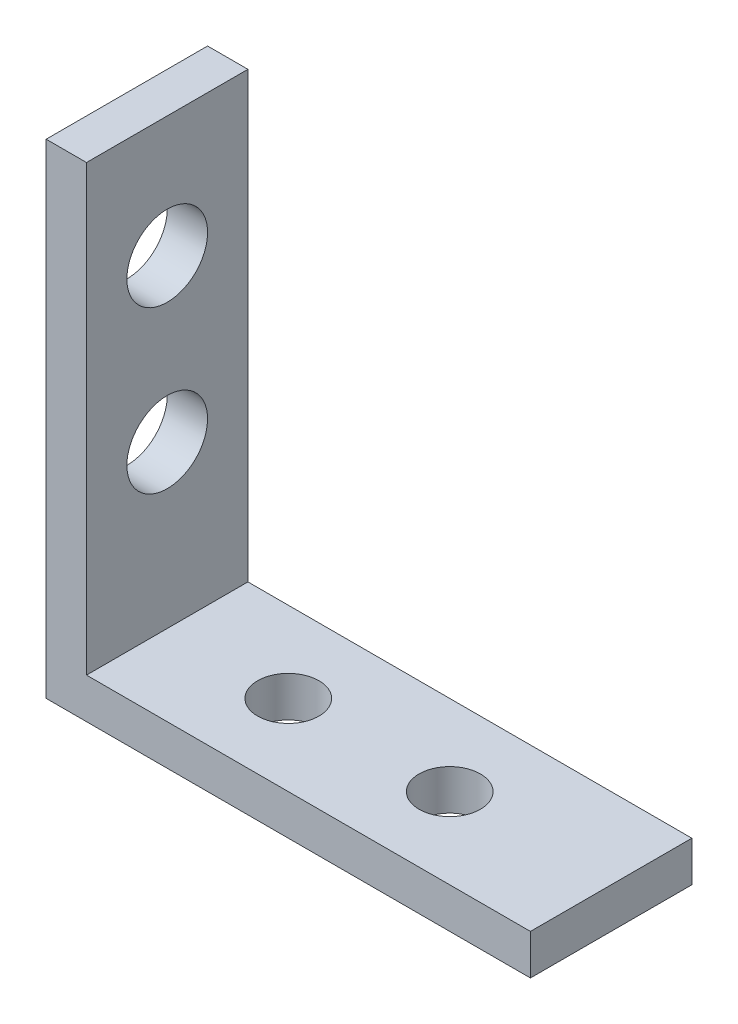
ISO-10303-21;
HEADER;
FILE_DESCRIPTION(('STEP AP214'),'2;1');
FILE_NAME('part.step','',(''),(''),'','','');
FILE_SCHEMA(('AUTOMOTIVE_DESIGN { 1 0 10303 214 1 1 1 1 }'));
ENDSEC;
DATA;
#1=APPLICATION_CONTEXT('core data for automotive mechanical design processes');
#2=APPLICATION_PROTOCOL_DEFINITION('international standard','automotive_design',2000,#1);
#3=PRODUCT_CONTEXT('',#1,'mechanical');
#4=PRODUCT('Part','Part','',(#3));
#5=PRODUCT_RELATED_PRODUCT_CATEGORY('part','',(#4));
#6=PRODUCT_DEFINITION_FORMATION('','',#4);
#7=PRODUCT_DEFINITION_CONTEXT('part definition',#1,'design');
#8=PRODUCT_DEFINITION('design','',#6,#7);
#9=PRODUCT_DEFINITION_SHAPE('','',#8);
#10=(LENGTH_UNIT() NAMED_UNIT(*) SI_UNIT(.MILLI.,.METRE.));
#11=(NAMED_UNIT(*) PLANE_ANGLE_UNIT() SI_UNIT($,.RADIAN.));
#12=(NAMED_UNIT(*) SI_UNIT($,.STERADIAN.) SOLID_ANGLE_UNIT());
#13=UNCERTAINTY_MEASURE_WITH_UNIT(LENGTH_MEASURE(1.E-05),#10,'distance_accuracy_value','');
#14=(GEOMETRIC_REPRESENTATION_CONTEXT(3) GLOBAL_UNCERTAINTY_ASSIGNED_CONTEXT((#13)) GLOBAL_UNIT_ASSIGNED_CONTEXT((#10,
#11,#12)) REPRESENTATION_CONTEXT('',''));
#15=CARTESIAN_POINT('',(0.,0.,0.));
#16=DIRECTION('',(0.,0.,1.));
#17=DIRECTION('',(1.,0.,0.));
#18=AXIS2_PLACEMENT_3D('',#15,#16,#17);
#19=CARTESIAN_POINT('',(38.1,0.,12.7));
#20=DIRECTION('',(0.,1.,0.));
#21=DIRECTION('',(-1.,0.,0.));
#22=AXIS2_PLACEMENT_3D('',#19,#20,#21);
#23=PLANE('',#22);
#24=CARTESIAN_POINT('',(25.4,0.,6.35));
#25=DIRECTION('',(0.,1.,0.));
#26=DIRECTION('',(-1.,0.,0.));
#27=AXIS2_PLACEMENT_3D('',#24,#25,#26);
#28=CIRCLE('',#27,2.413);
#29=CARTESIAN_POINT('',(22.987,0.,6.35));
#30=VERTEX_POINT('',#29);
#31=EDGE_CURVE('E162',#30,#30,#28,.T.);
#32=ORIENTED_EDGE('',*,*,#31,.T.);
#33=EDGE_LOOP('',(#32));
#34=FACE_BOUND('',#33,.T.);
#35=CARTESIAN_POINT('',(12.7,0.,6.35));
#36=DIRECTION('',(0.,1.,0.));
#37=DIRECTION('',(-1.,0.,0.));
#38=AXIS2_PLACEMENT_3D('',#35,#36,#37);
#39=CIRCLE('',#38,2.413);
#40=CARTESIAN_POINT('',(10.287,0.,6.35));
#41=VERTEX_POINT('',#40);
#42=EDGE_CURVE('E120',#41,#41,#39,.T.);
#43=ORIENTED_EDGE('',*,*,#42,.T.);
#44=EDGE_LOOP('',(#43));
#45=FACE_BOUND('',#44,.T.);
#46=DIRECTION('',(1.,0.,0.));
#47=VECTOR('',#46,1.);
#48=CARTESIAN_POINT('',(38.1,0.,0.));
#49=LINE('',#48,#47);
#50=CARTESIAN_POINT('',(0.,0.,0.));
#51=VERTEX_POINT('',#50);
#52=CARTESIAN_POINT('',(38.1,0.,0.));
#53=VERTEX_POINT('',#52);
#54=EDGE_CURVE('E116',#51,#53,#49,.T.);
#55=ORIENTED_EDGE('',*,*,#54,.T.);
#56=DIRECTION('',(0.,0.,-1.));
#57=VECTOR('',#56,1.);
#58=CARTESIAN_POINT('',(38.1,0.,12.7));
#59=LINE('',#58,#57);
#60=CARTESIAN_POINT('',(38.1,0.,12.7));
#61=VERTEX_POINT('',#60);
#62=EDGE_CURVE('E11',#61,#53,#59,.T.);
#63=ORIENTED_EDGE('',*,*,#62,.F.);
#64=DIRECTION('',(1.,0.,0.));
#65=VECTOR('',#64,1.);
#66=CARTESIAN_POINT('',(38.1,0.,12.7));
#67=LINE('',#66,#65);
#68=CARTESIAN_POINT('',(0.,0.,12.7));
#69=VERTEX_POINT('',#68);
#70=EDGE_CURVE('E127',#69,#61,#67,.T.);
#71=ORIENTED_EDGE('',*,*,#70,.F.);
#72=DIRECTION('',(0.,0.,-1.));
#73=VECTOR('',#72,1.);
#74=CARTESIAN_POINT('',(0.,0.,12.7));
#75=LINE('',#74,#73);
#76=EDGE_CURVE('E112',#69,#51,#75,.T.);
#77=ORIENTED_EDGE('',*,*,#76,.T.);
#78=EDGE_LOOP('',(#55,#63,#71,#77));
#79=FACE_BOUND('',#78,.T.);
#80=ADVANCED_FACE('F32',(#34,#45,#79),#23,.F.);
#81=CARTESIAN_POINT('',(38.1,3.175,12.7));
#82=DIRECTION('',(-1.,0.,0.));
#83=DIRECTION('',(0.,0.,1.));
#84=AXIS2_PLACEMENT_3D('',#81,#82,#83);
#85=PLANE('',#84);
#86=DIRECTION('',(0.,1.,0.));
#87=VECTOR('',#86,1.);
#88=CARTESIAN_POINT('',(38.1,3.175,0.));
#89=LINE('',#88,#87);
#90=CARTESIAN_POINT('',(38.1,3.175,0.));
#91=VERTEX_POINT('',#90);
#92=EDGE_CURVE('E119',#53,#91,#89,.T.);
#93=ORIENTED_EDGE('',*,*,#92,.T.);
#94=DIRECTION('',(0.,0.,-1.));
#95=VECTOR('',#94,1.);
#96=CARTESIAN_POINT('',(38.1,3.175,12.7));
#97=LINE('',#96,#95);
#98=CARTESIAN_POINT('',(38.1,3.175,12.7));
#99=VERTEX_POINT('',#98);
#100=EDGE_CURVE('E40',#99,#91,#97,.T.);
#101=ORIENTED_EDGE('',*,*,#100,.F.);
#102=DIRECTION('',(0.,1.,0.));
#103=VECTOR('',#102,1.);
#104=CARTESIAN_POINT('',(38.1,3.175,12.7));
#105=LINE('',#104,#103);
#106=EDGE_CURVE('E85',#61,#99,#105,.T.);
#107=ORIENTED_EDGE('',*,*,#106,.F.);
#108=ORIENTED_EDGE('',*,*,#62,.T.);
#109=EDGE_LOOP('',(#93,#101,#107,#108));
#110=FACE_BOUND('',#109,.T.);
#111=ADVANCED_FACE('F154',(#110),#85,.F.);
#112=CARTESIAN_POINT('',(3.17500000000001,3.175,12.7));
#113=DIRECTION('',(0.,-1.,0.));
#114=DIRECTION('',(1.,0.,0.));
#115=AXIS2_PLACEMENT_3D('',#112,#113,#114);
#116=PLANE('',#115);
#117=CARTESIAN_POINT('',(25.4,3.175,6.35));
#118=DIRECTION('',(0.,1.,0.));
#119=DIRECTION('',(-1.,0.,0.));
#120=AXIS2_PLACEMENT_3D('',#117,#118,#119);
#121=CIRCLE('',#120,2.413);
#122=CARTESIAN_POINT('',(22.987,3.175,6.35));
#123=VERTEX_POINT('',#122);
#124=EDGE_CURVE('E171',#123,#123,#121,.T.);
#125=ORIENTED_EDGE('',*,*,#124,.F.);
#126=EDGE_LOOP('',(#125));
#127=FACE_BOUND('',#126,.T.);
#128=CARTESIAN_POINT('',(12.7,3.175,6.35));
#129=DIRECTION('',(0.,1.,0.));
#130=DIRECTION('',(-1.,0.,0.));
#131=AXIS2_PLACEMENT_3D('',#128,#129,#130);
#132=CIRCLE('',#131,2.413);
#133=CARTESIAN_POINT('',(10.287,3.175,6.35));
#134=VERTEX_POINT('',#133);
#135=EDGE_CURVE('E166',#134,#134,#132,.T.);
#136=ORIENTED_EDGE('',*,*,#135,.F.);
#137=EDGE_LOOP('',(#136));
#138=FACE_BOUND('',#137,.T.);
#139=DIRECTION('',(-1.,0.,0.));
#140=VECTOR('',#139,1.);
#141=CARTESIAN_POINT('',(3.17500000000001,3.175,0.));
#142=LINE('',#141,#140);
#143=CARTESIAN_POINT('',(3.17500000000001,3.175,0.));
#144=VERTEX_POINT('',#143);
#145=EDGE_CURVE('E122',#91,#144,#142,.T.);
#146=ORIENTED_EDGE('',*,*,#145,.T.);
#147=DIRECTION('',(0.,0.,-1.));
#148=VECTOR('',#147,1.);
#149=CARTESIAN_POINT('',(3.17500000000001,3.175,12.7));
#150=LINE('',#149,#148);
#151=CARTESIAN_POINT('',(3.17500000000001,3.175,12.7));
#152=VERTEX_POINT('',#151);
#153=EDGE_CURVE('E107',#152,#144,#150,.T.);
#154=ORIENTED_EDGE('',*,*,#153,.F.);
#155=DIRECTION('',(-1.,0.,0.));
#156=VECTOR('',#155,1.);
#157=CARTESIAN_POINT('',(3.17500000000001,3.175,12.7));
#158=LINE('',#157,#156);
#159=EDGE_CURVE('E98',#99,#152,#158,.T.);
#160=ORIENTED_EDGE('',*,*,#159,.F.);
#161=ORIENTED_EDGE('',*,*,#100,.T.);
#162=EDGE_LOOP('',(#146,#154,#160,#161));
#163=FACE_BOUND('',#162,.T.);
#164=ADVANCED_FACE('F133',(#127,#138,#163),#116,.F.);
#165=CARTESIAN_POINT('',(3.175,38.1,12.7));
#166=DIRECTION('',(-1.,0.,0.));
#167=DIRECTION('',(0.,-1.,0.));
#168=AXIS2_PLACEMENT_3D('',#165,#166,#167);
#169=PLANE('',#168);
#170=CARTESIAN_POINT('',(3.175,15.875,6.35));
#171=DIRECTION('',(1.,0.,0.));
#172=DIRECTION('',(0.,1.,0.));
#173=AXIS2_PLACEMENT_3D('',#170,#171,#172);
#174=CIRCLE('',#173,3.175);
#175=CARTESIAN_POINT('',(3.175,19.05,6.35));
#176=VERTEX_POINT('',#175);
#177=EDGE_CURVE('E184',#176,#176,#174,.T.);
#178=ORIENTED_EDGE('',*,*,#177,.F.);
#179=EDGE_LOOP('',(#178));
#180=FACE_BOUND('',#179,.T.);
#181=CARTESIAN_POINT('',(3.175,28.575,6.35));
#182=DIRECTION('',(1.,0.,0.));
#183=DIRECTION('',(0.,1.,0.));
#184=AXIS2_PLACEMENT_3D('',#181,#182,#183);
#185=CIRCLE('',#184,3.175);
#186=CARTESIAN_POINT('',(3.175,31.75,6.35));
#187=VERTEX_POINT('',#186);
#188=EDGE_CURVE('E178',#187,#187,#185,.T.);
#189=ORIENTED_EDGE('',*,*,#188,.F.);
#190=EDGE_LOOP('',(#189));
#191=FACE_BOUND('',#190,.T.);
#192=DIRECTION('',(0.,1.,0.));
#193=VECTOR('',#192,1.);
#194=CARTESIAN_POINT('',(3.175,38.1,0.));
#195=LINE('',#194,#193);
#196=CARTESIAN_POINT('',(3.175,38.1,0.));
#197=VERTEX_POINT('',#196);
#198=EDGE_CURVE('E106',#144,#197,#195,.T.);
#199=ORIENTED_EDGE('',*,*,#198,.T.);
#200=DIRECTION('',(0.,0.,-1.));
#201=VECTOR('',#200,1.);
#202=CARTESIAN_POINT('',(3.175,38.1,12.7));
#203=LINE('',#202,#201);
#204=CARTESIAN_POINT('',(3.175,38.1,12.7));
#205=VERTEX_POINT('',#204);
#206=EDGE_CURVE('E103',#205,#197,#203,.T.);
#207=ORIENTED_EDGE('',*,*,#206,.F.);
#208=DIRECTION('',(0.,1.,0.));
#209=VECTOR('',#208,1.);
#210=CARTESIAN_POINT('',(3.175,38.1,12.7));
#211=LINE('',#210,#209);
#212=EDGE_CURVE('E92',#152,#205,#211,.T.);
#213=ORIENTED_EDGE('',*,*,#212,.F.);
#214=ORIENTED_EDGE('',*,*,#153,.T.);
#215=EDGE_LOOP('',(#199,#207,#213,#214));
#216=FACE_BOUND('',#215,.T.);
#217=ADVANCED_FACE('F104',(#180,#191,#216),#169,.F.);
#218=CARTESIAN_POINT('',(0.,38.1,12.7));
#219=DIRECTION('',(0.,-1.,0.));
#220=DIRECTION('',(0.,0.,-1.));
#221=AXIS2_PLACEMENT_3D('',#218,#219,#220);
#222=PLANE('',#221);
#223=DIRECTION('',(-1.,0.,0.));
#224=VECTOR('',#223,1.);
#225=CARTESIAN_POINT('',(0.,38.1,0.));
#226=LINE('',#225,#224);
#227=CARTESIAN_POINT('',(0.,38.1,0.));
#228=VERTEX_POINT('',#227);
#229=EDGE_CURVE('E71',#197,#228,#226,.T.);
#230=ORIENTED_EDGE('',*,*,#229,.T.);
#231=DIRECTION('',(0.,0.,-1.));
#232=VECTOR('',#231,1.);
#233=CARTESIAN_POINT('',(0.,38.1,12.7));
#234=LINE('',#233,#232);
#235=CARTESIAN_POINT('',(0.,38.1,12.7));
#236=VERTEX_POINT('',#235);
#237=EDGE_CURVE('E108',#236,#228,#234,.T.);
#238=ORIENTED_EDGE('',*,*,#237,.F.);
#239=DIRECTION('',(-1.,0.,0.));
#240=VECTOR('',#239,1.);
#241=CARTESIAN_POINT('',(0.,38.1,12.7));
#242=LINE('',#241,#240);
#243=EDGE_CURVE('E96',#205,#236,#242,.T.);
#244=ORIENTED_EDGE('',*,*,#243,.F.);
#245=ORIENTED_EDGE('',*,*,#206,.T.);
#246=EDGE_LOOP('',(#230,#238,#244,#245));
#247=FACE_BOUND('',#246,.T.);
#248=ADVANCED_FACE('F110',(#247),#222,.F.);
#249=CARTESIAN_POINT('',(0.,0.,12.7));
#250=DIRECTION('',(1.,0.,0.));
#251=DIRECTION('',(0.,0.,-1.));
#252=AXIS2_PLACEMENT_3D('',#249,#250,#251);
#253=PLANE('',#252);
#254=CARTESIAN_POINT('',(0.,15.875,6.35));
#255=DIRECTION('',(1.,0.,0.));
#256=DIRECTION('',(0.,1.,0.));
#257=AXIS2_PLACEMENT_3D('',#254,#255,#256);
#258=CIRCLE('',#257,3.175);
#259=CARTESIAN_POINT('',(0.,19.05,6.35));
#260=VERTEX_POINT('',#259);
#261=EDGE_CURVE('E181',#260,#260,#258,.T.);
#262=ORIENTED_EDGE('',*,*,#261,.T.);
#263=EDGE_LOOP('',(#262));
#264=FACE_BOUND('',#263,.T.);
#265=CARTESIAN_POINT('',(0.,28.575,6.35));
#266=DIRECTION('',(1.,0.,0.));
#267=DIRECTION('',(0.,1.,0.));
#268=AXIS2_PLACEMENT_3D('',#265,#266,#267);
#269=CIRCLE('',#268,3.175);
#270=CARTESIAN_POINT('',(0.,31.75,6.35));
#271=VERTEX_POINT('',#270);
#272=EDGE_CURVE('E176',#271,#271,#269,.T.);
#273=ORIENTED_EDGE('',*,*,#272,.T.);
#274=EDGE_LOOP('',(#273));
#275=FACE_BOUND('',#274,.T.);
#276=DIRECTION('',(0.,-1.,0.));
#277=VECTOR('',#276,1.);
#278=CARTESIAN_POINT('',(0.,0.,0.));
#279=LINE('',#278,#277);
#280=EDGE_CURVE('E77',#228,#51,#279,.T.);
#281=ORIENTED_EDGE('',*,*,#280,.T.);
#282=ORIENTED_EDGE('',*,*,#76,.F.);
#283=DIRECTION('',(0.,-1.,0.));
#284=VECTOR('',#283,1.);
#285=CARTESIAN_POINT('',(0.,0.,12.7));
#286=LINE('',#285,#284);
#287=EDGE_CURVE('E48',#236,#69,#286,.T.);
#288=ORIENTED_EDGE('',*,*,#287,.F.);
#289=ORIENTED_EDGE('',*,*,#237,.T.);
#290=EDGE_LOOP('',(#281,#282,#288,#289));
#291=FACE_BOUND('',#290,.T.);
#292=ADVANCED_FACE('F140',(#264,#275,#291),#253,.F.);
#293=CARTESIAN_POINT('',(0.,0.,12.7));
#294=DIRECTION('',(0.,0.,-1.));
#295=DIRECTION('',(-1.,0.,0.));
#296=AXIS2_PLACEMENT_3D('',#293,#294,#295);
#297=PLANE('',#296);
#298=ORIENTED_EDGE('',*,*,#70,.T.);
#299=ORIENTED_EDGE('',*,*,#106,.T.);
#300=ORIENTED_EDGE('',*,*,#159,.T.);
#301=ORIENTED_EDGE('',*,*,#212,.T.);
#302=ORIENTED_EDGE('',*,*,#243,.T.);
#303=ORIENTED_EDGE('',*,*,#287,.T.);
#304=EDGE_LOOP('',(#298,#299,#300,#301,#302,#303));
#305=FACE_BOUND('',#304,.T.);
#306=ADVANCED_FACE('F94',(#305),#297,.F.);
#307=CARTESIAN_POINT('',(0.,0.,0.));
#308=DIRECTION('',(0.,0.,-1.));
#309=DIRECTION('',(-1.,0.,0.));
#310=AXIS2_PLACEMENT_3D('',#307,#308,#309);
#311=PLANE('',#310);
#312=ORIENTED_EDGE('',*,*,#54,.F.);
#313=ORIENTED_EDGE('',*,*,#280,.F.);
#314=ORIENTED_EDGE('',*,*,#229,.F.);
#315=ORIENTED_EDGE('',*,*,#198,.F.);
#316=ORIENTED_EDGE('',*,*,#145,.F.);
#317=ORIENTED_EDGE('',*,*,#92,.F.);
#318=EDGE_LOOP('',(#312,#313,#314,#315,#316,#317));
#319=FACE_BOUND('',#318,.T.);
#320=ADVANCED_FACE('F136',(#319),#311,.T.);
#321=CARTESIAN_POINT('',(12.7,0.,6.35));
#322=DIRECTION('',(0.,1.,0.));
#323=DIRECTION('',(-1.,0.,0.));
#324=AXIS2_PLACEMENT_3D('',#321,#322,#323);
#325=CYLINDRICAL_SURFACE('',#324,2.413);
#326=ORIENTED_EDGE('',*,*,#42,.F.);
#327=EDGE_LOOP('',(#326));
#328=FACE_BOUND('',#327,.T.);
#329=ORIENTED_EDGE('',*,*,#135,.T.);
#330=EDGE_LOOP('',(#329));
#331=FACE_BOUND('',#330,.T.);
#332=ADVANCED_FACE('F208',(#328,#331),#325,.F.);
#333=CARTESIAN_POINT('',(25.4,0.,6.35));
#334=DIRECTION('',(0.,1.,0.));
#335=DIRECTION('',(-1.,0.,0.));
#336=AXIS2_PLACEMENT_3D('',#333,#334,#335);
#337=CYLINDRICAL_SURFACE('',#336,2.413);
#338=ORIENTED_EDGE('',*,*,#31,.F.);
#339=EDGE_LOOP('',(#338));
#340=FACE_BOUND('',#339,.T.);
#341=ORIENTED_EDGE('',*,*,#124,.T.);
#342=EDGE_LOOP('',(#341));
#343=FACE_BOUND('',#342,.T.);
#344=ADVANCED_FACE('F202',(#340,#343),#337,.F.);
#345=CARTESIAN_POINT('',(0.,28.575,6.35));
#346=DIRECTION('',(1.,0.,0.));
#347=DIRECTION('',(0.,1.,0.));
#348=AXIS2_PLACEMENT_3D('',#345,#346,#347);
#349=CYLINDRICAL_SURFACE('',#348,3.175);
#350=ORIENTED_EDGE('',*,*,#272,.F.);
#351=EDGE_LOOP('',(#350));
#352=FACE_BOUND('',#351,.T.);
#353=ORIENTED_EDGE('',*,*,#188,.T.);
#354=EDGE_LOOP('',(#353));
#355=FACE_BOUND('',#354,.T.);
#356=ADVANCED_FACE('F192',(#352,#355),#349,.F.);
#357=CARTESIAN_POINT('',(0.,15.875,6.35));
#358=DIRECTION('',(1.,0.,0.));
#359=DIRECTION('',(0.,1.,0.));
#360=AXIS2_PLACEMENT_3D('',#357,#358,#359);
#361=CYLINDRICAL_SURFACE('',#360,3.175);
#362=ORIENTED_EDGE('',*,*,#261,.F.);
#363=EDGE_LOOP('',(#362));
#364=FACE_BOUND('',#363,.T.);
#365=ORIENTED_EDGE('',*,*,#177,.T.);
#366=EDGE_LOOP('',(#365));
#367=FACE_BOUND('',#366,.T.);
#368=ADVANCED_FACE('F189',(#364,#367),#361,.F.);
#369=CLOSED_SHELL('',(#80,#111,#164,#217,#248,#292,#306,#320,#332,#344,#356,#368));
#370=MANIFOLD_SOLID_BREP('B2',#369);
#371=ADVANCED_BREP_SHAPE_REPRESENTATION('',(#18,#370),#14);
#372=SHAPE_DEFINITION_REPRESENTATION(#9,#371);
ENDSEC;
END-ISO-10303-21;
